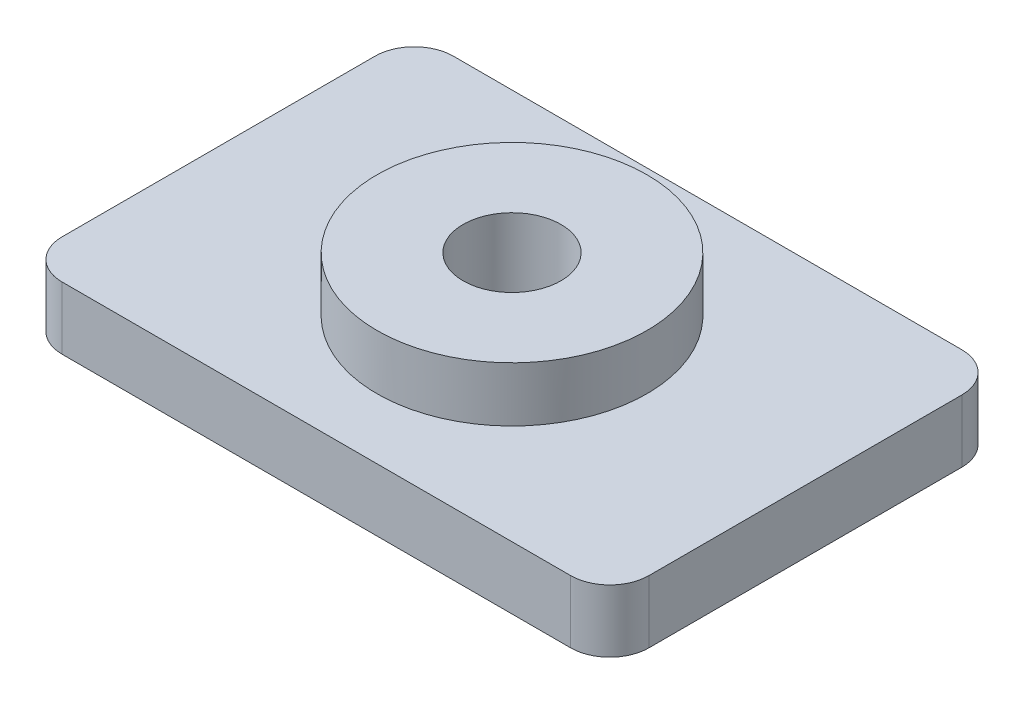
ISO-10303-21;
HEADER;
FILE_DESCRIPTION(('STEP AP214'),'2;1');
FILE_NAME('part.step','',(''),(''),'','','');
FILE_SCHEMA(('AUTOMOTIVE_DESIGN { 1 0 10303 214 1 1 1 1 }'));
ENDSEC;
DATA;
#1=APPLICATION_CONTEXT('core data for automotive mechanical design processes');
#2=APPLICATION_PROTOCOL_DEFINITION('international standard','automotive_design',2000,#1);
#3=PRODUCT_CONTEXT('',#1,'mechanical');
#4=PRODUCT('Part','Part','',(#3));
#5=PRODUCT_RELATED_PRODUCT_CATEGORY('part','',(#4));
#6=PRODUCT_DEFINITION_FORMATION('','',#4);
#7=PRODUCT_DEFINITION_CONTEXT('part definition',#1,'design');
#8=PRODUCT_DEFINITION('design','',#6,#7);
#9=PRODUCT_DEFINITION_SHAPE('','',#8);
#10=(LENGTH_UNIT() NAMED_UNIT(*) SI_UNIT(.MILLI.,.METRE.));
#11=(NAMED_UNIT(*) PLANE_ANGLE_UNIT() SI_UNIT($,.RADIAN.));
#12=(NAMED_UNIT(*) SI_UNIT($,.STERADIAN.) SOLID_ANGLE_UNIT());
#13=UNCERTAINTY_MEASURE_WITH_UNIT(LENGTH_MEASURE(1.E-05),#10,'distance_accuracy_value','');
#14=(GEOMETRIC_REPRESENTATION_CONTEXT(3) GLOBAL_UNCERTAINTY_ASSIGNED_CONTEXT((#13)) GLOBAL_UNIT_ASSIGNED_CONTEXT((#10,
#11,#12)) REPRESENTATION_CONTEXT('',''));
#15=CARTESIAN_POINT('',(0.,0.,0.));
#16=DIRECTION('',(0.,0.,1.));
#17=DIRECTION('',(1.,0.,0.));
#18=AXIS2_PLACEMENT_3D('',#15,#16,#17);
#19=CARTESIAN_POINT('',(14.,1.6,-9.));
#20=DIRECTION('',(0.,-1.,0.));
#21=DIRECTION('',(0.,0.,-1.));
#22=AXIS2_PLACEMENT_3D('',#19,#20,#21);
#23=PLANE('',#22);
#24=CARTESIAN_POINT('',(14.,1.6,-9.));
#25=DIRECTION('',(0.,1.,0.));
#26=DIRECTION('',(0.,0.,-1.));
#27=AXIS2_PLACEMENT_3D('',#24,#25,#26);
#28=CIRCLE('',#27,1.);
#29=CARTESIAN_POINT('',(15.,1.6,-8.99999999999999));
#30=VERTEX_POINT('',#29);
#31=CARTESIAN_POINT('',(14.,1.6,-10.));
#32=VERTEX_POINT('',#31);
#33=EDGE_CURVE('E145',#30,#32,#28,.T.);
#34=ORIENTED_EDGE('',*,*,#33,.T.);
#35=DIRECTION('',(-1.,0.,0.));
#36=VECTOR('',#35,1.);
#37=CARTESIAN_POINT('',(1.00000000000001,1.6,-10.));
#38=LINE('',#37,#36);
#39=CARTESIAN_POINT('',(1.00000000000001,1.6,-10.));
#40=VERTEX_POINT('',#39);
#41=EDGE_CURVE('E93',#32,#40,#38,.T.);
#42=ORIENTED_EDGE('',*,*,#41,.T.);
#43=CARTESIAN_POINT('',(1.,1.6,-9.));
#44=DIRECTION('',(0.,1.,0.));
#45=DIRECTION('',(0.,0.,-1.));
#46=AXIS2_PLACEMENT_3D('',#43,#44,#45);
#47=CIRCLE('',#46,1.);
#48=CARTESIAN_POINT('',(0.,1.6,-8.99999999999999));
#49=VERTEX_POINT('',#48);
#50=EDGE_CURVE('E176',#40,#49,#47,.T.);
#51=ORIENTED_EDGE('',*,*,#50,.T.);
#52=DIRECTION('',(0.,0.,1.));
#53=VECTOR('',#52,1.);
#54=CARTESIAN_POINT('',(0.,1.6,-1.00000000000001));
#55=LINE('',#54,#53);
#56=CARTESIAN_POINT('',(0.,1.6,-1.00000000000001));
#57=VERTEX_POINT('',#56);
#58=EDGE_CURVE('E175',#49,#57,#55,.T.);
#59=ORIENTED_EDGE('',*,*,#58,.T.);
#60=CARTESIAN_POINT('',(1.,1.6,-1.));
#61=DIRECTION('',(0.,1.,0.));
#62=DIRECTION('',(0.,0.,-1.));
#63=AXIS2_PLACEMENT_3D('',#60,#61,#62);
#64=CIRCLE('',#63,1.);
#65=CARTESIAN_POINT('',(1.00000000000001,1.6,0.));
#66=VERTEX_POINT('',#65);
#67=EDGE_CURVE('E112',#57,#66,#64,.T.);
#68=ORIENTED_EDGE('',*,*,#67,.T.);
#69=DIRECTION('',(1.,0.,0.));
#70=VECTOR('',#69,1.);
#71=CARTESIAN_POINT('',(1.00000000000001,1.6,0.));
#72=LINE('',#71,#70);
#73=CARTESIAN_POINT('',(14.,1.6,0.));
#74=VERTEX_POINT('',#73);
#75=EDGE_CURVE('E106',#66,#74,#72,.T.);
#76=ORIENTED_EDGE('',*,*,#75,.T.);
#77=CARTESIAN_POINT('',(14.,1.6,-1.));
#78=DIRECTION('',(0.,1.,0.));
#79=DIRECTION('',(0.,0.,1.));
#80=AXIS2_PLACEMENT_3D('',#77,#78,#79);
#81=CIRCLE('',#80,1.);
#82=CARTESIAN_POINT('',(15.,1.6,-1.00000000000001));
#83=VERTEX_POINT('',#82);
#84=EDGE_CURVE('E110',#74,#83,#81,.T.);
#85=ORIENTED_EDGE('',*,*,#84,.T.);
#86=DIRECTION('',(0.,0.,-1.));
#87=VECTOR('',#86,1.);
#88=CARTESIAN_POINT('',(15.,1.6,-1.00000000000001));
#89=LINE('',#88,#87);
#90=EDGE_CURVE('E49',#83,#30,#89,.T.);
#91=ORIENTED_EDGE('',*,*,#90,.T.);
#92=EDGE_LOOP('',(#34,#42,#51,#59,#68,#76,#85,#91));
#93=FACE_BOUND('',#92,.T.);
#94=CARTESIAN_POINT('',(7.5,1.6,-5.));
#95=DIRECTION('',(0.,-1.,0.));
#96=DIRECTION('',(0.,0.,-1.));
#97=AXIS2_PLACEMENT_3D('',#94,#95,#96);
#98=CIRCLE('',#97,3.45);
#99=CARTESIAN_POINT('',(7.5,1.6,-8.45));
#100=VERTEX_POINT('',#99);
#101=EDGE_CURVE('E11',#100,#100,#98,.F.);
#102=ORIENTED_EDGE('',*,*,#101,.F.);
#103=EDGE_LOOP('',(#102));
#104=FACE_BOUND('',#103,.T.);
#105=ADVANCED_FACE('F32',(#93,#104),#23,.F.);
#106=CARTESIAN_POINT('',(14.,1.6,-9.));
#107=DIRECTION('',(0.,-1.,0.));
#108=DIRECTION('',(0.,0.,-1.));
#109=AXIS2_PLACEMENT_3D('',#106,#107,#108);
#110=CYLINDRICAL_SURFACE('',#109,1.);
#111=CARTESIAN_POINT('',(14.,0.,-9.));
#112=DIRECTION('',(0.,1.,0.));
#113=DIRECTION('',(0.,0.,-1.));
#114=AXIS2_PLACEMENT_3D('',#111,#112,#113);
#115=CIRCLE('',#114,1.);
#116=CARTESIAN_POINT('',(15.,0.,-8.99999999999999));
#117=VERTEX_POINT('',#116);
#118=CARTESIAN_POINT('',(14.,0.,-10.));
#119=VERTEX_POINT('',#118);
#120=EDGE_CURVE('E130',#117,#119,#115,.T.);
#121=ORIENTED_EDGE('',*,*,#120,.T.);
#122=DIRECTION('',(0.,-1.,0.));
#123=VECTOR('',#122,1.);
#124=CARTESIAN_POINT('',(14.,1.6,-10.));
#125=LINE('',#124,#123);
#126=EDGE_CURVE('E41',#32,#119,#125,.T.);
#127=ORIENTED_EDGE('',*,*,#126,.F.);
#128=ORIENTED_EDGE('',*,*,#33,.F.);
#129=DIRECTION('',(0.,-1.,0.));
#130=VECTOR('',#129,1.);
#131=CARTESIAN_POINT('',(15.,1.6,-8.99999999999999));
#132=LINE('',#131,#130);
#133=EDGE_CURVE('E126',#30,#117,#132,.T.);
#134=ORIENTED_EDGE('',*,*,#133,.T.);
#135=EDGE_LOOP('',(#121,#127,#128,#134));
#136=FACE_BOUND('',#135,.T.);
#137=ADVANCED_FACE('F34',(#136),#110,.T.);
#138=CARTESIAN_POINT('',(1.00000000000001,1.6,-10.));
#139=DIRECTION('',(0.,0.,1.));
#140=DIRECTION('',(1.,0.,0.));
#141=AXIS2_PLACEMENT_3D('',#138,#139,#140);
#142=PLANE('',#141);
#143=DIRECTION('',(-1.,0.,0.));
#144=VECTOR('',#143,1.);
#145=CARTESIAN_POINT('',(1.00000000000001,0.,-10.));
#146=LINE('',#145,#144);
#147=CARTESIAN_POINT('',(1.00000000000001,0.,-10.));
#148=VERTEX_POINT('',#147);
#149=EDGE_CURVE('E133',#119,#148,#146,.T.);
#150=ORIENTED_EDGE('',*,*,#149,.T.);
#151=DIRECTION('',(0.,-1.,0.));
#152=VECTOR('',#151,1.);
#153=CARTESIAN_POINT('',(1.00000000000001,1.6,-10.));
#154=LINE('',#153,#152);
#155=EDGE_CURVE('E155',#40,#148,#154,.T.);
#156=ORIENTED_EDGE('',*,*,#155,.F.);
#157=ORIENTED_EDGE('',*,*,#41,.F.);
#158=ORIENTED_EDGE('',*,*,#126,.T.);
#159=EDGE_LOOP('',(#150,#156,#157,#158));
#160=FACE_BOUND('',#159,.T.);
#161=ADVANCED_FACE('F158',(#160),#142,.F.);
#162=CARTESIAN_POINT('',(1.,1.6,-9.));
#163=DIRECTION('',(0.,-1.,0.));
#164=DIRECTION('',(0.,0.,-1.));
#165=AXIS2_PLACEMENT_3D('',#162,#163,#164);
#166=CYLINDRICAL_SURFACE('',#165,1.);
#167=CARTESIAN_POINT('',(1.,0.,-9.));
#168=DIRECTION('',(0.,1.,0.));
#169=DIRECTION('',(0.,0.,-1.));
#170=AXIS2_PLACEMENT_3D('',#167,#168,#169);
#171=CIRCLE('',#170,1.);
#172=CARTESIAN_POINT('',(0.,0.,-8.99999999999999));
#173=VERTEX_POINT('',#172);
#174=EDGE_CURVE('E136',#148,#173,#171,.T.);
#175=ORIENTED_EDGE('',*,*,#174,.T.);
#176=DIRECTION('',(0.,-1.,0.));
#177=VECTOR('',#176,1.);
#178=CARTESIAN_POINT('',(0.,1.6,-8.99999999999999));
#179=LINE('',#178,#177);
#180=EDGE_CURVE('E152',#49,#173,#179,.T.);
#181=ORIENTED_EDGE('',*,*,#180,.F.);
#182=ORIENTED_EDGE('',*,*,#50,.F.);
#183=ORIENTED_EDGE('',*,*,#155,.T.);
#184=EDGE_LOOP('',(#175,#181,#182,#183));
#185=FACE_BOUND('',#184,.T.);
#186=ADVANCED_FACE('F169',(#185),#166,.T.);
#187=CARTESIAN_POINT('',(0.,1.6,-1.00000000000001));
#188=DIRECTION('',(1.,0.,0.));
#189=DIRECTION('',(0.,0.,-1.));
#190=AXIS2_PLACEMENT_3D('',#187,#188,#189);
#191=PLANE('',#190);
#192=DIRECTION('',(0.,0.,1.));
#193=VECTOR('',#192,1.);
#194=CARTESIAN_POINT('',(0.,0.,-1.00000000000001));
#195=LINE('',#194,#193);
#196=CARTESIAN_POINT('',(0.,0.,-1.00000000000001));
#197=VERTEX_POINT('',#196);
#198=EDGE_CURVE('E138',#173,#197,#195,.T.);
#199=ORIENTED_EDGE('',*,*,#198,.T.);
#200=DIRECTION('',(0.,-1.,0.));
#201=VECTOR('',#200,1.);
#202=CARTESIAN_POINT('',(0.,1.6,-1.00000000000001));
#203=LINE('',#202,#201);
#204=EDGE_CURVE('E149',#57,#197,#203,.T.);
#205=ORIENTED_EDGE('',*,*,#204,.F.);
#206=ORIENTED_EDGE('',*,*,#58,.F.);
#207=ORIENTED_EDGE('',*,*,#180,.T.);
#208=EDGE_LOOP('',(#199,#205,#206,#207));
#209=FACE_BOUND('',#208,.T.);
#210=ADVANCED_FACE('F173',(#209),#191,.F.);
#211=CARTESIAN_POINT('',(1.,1.6,-1.));
#212=DIRECTION('',(0.,-1.,0.));
#213=DIRECTION('',(0.,0.,-1.));
#214=AXIS2_PLACEMENT_3D('',#211,#212,#213);
#215=CYLINDRICAL_SURFACE('',#214,1.);
#216=CARTESIAN_POINT('',(1.,0.,-1.));
#217=DIRECTION('',(0.,1.,0.));
#218=DIRECTION('',(0.,0.,-1.));
#219=AXIS2_PLACEMENT_3D('',#216,#217,#218);
#220=CIRCLE('',#219,1.);
#221=CARTESIAN_POINT('',(1.00000000000001,0.,0.));
#222=VERTEX_POINT('',#221);
#223=EDGE_CURVE('E140',#197,#222,#220,.T.);
#224=ORIENTED_EDGE('',*,*,#223,.T.);
#225=DIRECTION('',(0.,-1.,0.));
#226=VECTOR('',#225,1.);
#227=CARTESIAN_POINT('',(1.00000000000001,1.6,0.));
#228=LINE('',#227,#226);
#229=EDGE_CURVE('E121',#66,#222,#228,.T.);
#230=ORIENTED_EDGE('',*,*,#229,.F.);
#231=ORIENTED_EDGE('',*,*,#67,.F.);
#232=ORIENTED_EDGE('',*,*,#204,.T.);
#233=EDGE_LOOP('',(#224,#230,#231,#232));
#234=FACE_BOUND('',#233,.T.);
#235=ADVANCED_FACE('F220',(#234),#215,.T.);
#236=CARTESIAN_POINT('',(1.00000000000001,1.6,0.));
#237=DIRECTION('',(0.,0.,-1.));
#238=DIRECTION('',(-1.,0.,0.));
#239=AXIS2_PLACEMENT_3D('',#236,#237,#238);
#240=PLANE('',#239);
#241=DIRECTION('',(1.,0.,0.));
#242=VECTOR('',#241,1.);
#243=CARTESIAN_POINT('',(1.00000000000001,0.,0.));
#244=LINE('',#243,#242);
#245=CARTESIAN_POINT('',(14.,0.,0.));
#246=VERTEX_POINT('',#245);
#247=EDGE_CURVE('E120',#222,#246,#244,.T.);
#248=ORIENTED_EDGE('',*,*,#247,.T.);
#249=DIRECTION('',(0.,-1.,0.));
#250=VECTOR('',#249,1.);
#251=CARTESIAN_POINT('',(14.,1.6,0.));
#252=LINE('',#251,#250);
#253=EDGE_CURVE('E117',#74,#246,#252,.T.);
#254=ORIENTED_EDGE('',*,*,#253,.F.);
#255=ORIENTED_EDGE('',*,*,#75,.F.);
#256=ORIENTED_EDGE('',*,*,#229,.T.);
#257=EDGE_LOOP('',(#248,#254,#255,#256));
#258=FACE_BOUND('',#257,.T.);
#259=ADVANCED_FACE('F118',(#258),#240,.F.);
#260=CARTESIAN_POINT('',(14.,1.6,-1.));
#261=DIRECTION('',(0.,-1.,0.));
#262=DIRECTION('',(0.,0.,-1.));
#263=AXIS2_PLACEMENT_3D('',#260,#261,#262);
#264=CYLINDRICAL_SURFACE('',#263,1.);
#265=CARTESIAN_POINT('',(14.,0.,-1.));
#266=DIRECTION('',(0.,1.,0.));
#267=DIRECTION('',(0.,0.,1.));
#268=AXIS2_PLACEMENT_3D('',#265,#266,#267);
#269=CIRCLE('',#268,1.);
#270=CARTESIAN_POINT('',(15.,0.,-1.00000000000001));
#271=VERTEX_POINT('',#270);
#272=EDGE_CURVE('E78',#246,#271,#269,.T.);
#273=ORIENTED_EDGE('',*,*,#272,.T.);
#274=DIRECTION('',(0.,-1.,0.));
#275=VECTOR('',#274,1.);
#276=CARTESIAN_POINT('',(15.,1.6,-1.00000000000001));
#277=LINE('',#276,#275);
#278=EDGE_CURVE('E122',#83,#271,#277,.T.);
#279=ORIENTED_EDGE('',*,*,#278,.F.);
#280=ORIENTED_EDGE('',*,*,#84,.F.);
#281=ORIENTED_EDGE('',*,*,#253,.T.);
#282=EDGE_LOOP('',(#273,#279,#280,#281));
#283=FACE_BOUND('',#282,.T.);
#284=ADVANCED_FACE('F124',(#283),#264,.T.);
#285=CARTESIAN_POINT('',(15.,1.6,-1.00000000000001));
#286=DIRECTION('',(-1.,0.,0.));
#287=DIRECTION('',(0.,0.,1.));
#288=AXIS2_PLACEMENT_3D('',#285,#286,#287);
#289=PLANE('',#288);
#290=DIRECTION('',(0.,0.,-1.));
#291=VECTOR('',#290,1.);
#292=CARTESIAN_POINT('',(15.,0.,-1.00000000000001));
#293=LINE('',#292,#291);
#294=EDGE_CURVE('E84',#271,#117,#293,.T.);
#295=ORIENTED_EDGE('',*,*,#294,.T.);
#296=ORIENTED_EDGE('',*,*,#133,.F.);
#297=ORIENTED_EDGE('',*,*,#90,.F.);
#298=ORIENTED_EDGE('',*,*,#278,.T.);
#299=EDGE_LOOP('',(#295,#296,#297,#298));
#300=FACE_BOUND('',#299,.T.);
#301=ADVANCED_FACE('F212',(#300),#289,.F.);
#302=CARTESIAN_POINT('',(14.,0.,-9.));
#303=DIRECTION('',(0.,-1.,0.));
#304=DIRECTION('',(0.,0.,-1.));
#305=AXIS2_PLACEMENT_3D('',#302,#303,#304);
#306=PLANE('',#305);
#307=CARTESIAN_POINT('',(7.5,0.,-5.));
#308=DIRECTION('',(0.,-1.,0.));
#309=DIRECTION('',(0.,0.,-1.));
#310=AXIS2_PLACEMENT_3D('',#307,#308,#309);
#311=CIRCLE('',#310,1.25);
#312=CARTESIAN_POINT('',(7.5,0.,-6.25));
#313=VERTEX_POINT('',#312);
#314=EDGE_CURVE('E185',#313,#313,#311,.F.);
#315=ORIENTED_EDGE('',*,*,#314,.T.);
#316=EDGE_LOOP('',(#315));
#317=FACE_BOUND('',#316,.T.);
#318=ORIENTED_EDGE('',*,*,#120,.F.);
#319=ORIENTED_EDGE('',*,*,#294,.F.);
#320=ORIENTED_EDGE('',*,*,#272,.F.);
#321=ORIENTED_EDGE('',*,*,#247,.F.);
#322=ORIENTED_EDGE('',*,*,#223,.F.);
#323=ORIENTED_EDGE('',*,*,#198,.F.);
#324=ORIENTED_EDGE('',*,*,#174,.F.);
#325=ORIENTED_EDGE('',*,*,#149,.F.);
#326=EDGE_LOOP('',(#318,#319,#320,#321,#322,#323,#324,#325));
#327=FACE_BOUND('',#326,.T.);
#328=ADVANCED_FACE('F163',(#317,#327),#306,.T.);
#329=CARTESIAN_POINT('',(7.5,3.,-5.));
#330=DIRECTION('',(0.,-1.,0.));
#331=DIRECTION('',(0.,0.,-1.));
#332=AXIS2_PLACEMENT_3D('',#329,#330,#331);
#333=CYLINDRICAL_SURFACE('',#332,3.45);
#334=CARTESIAN_POINT('',(7.5,3.,-5.));
#335=DIRECTION('',(0.,1.,0.));
#336=DIRECTION('',(0.,0.,1.));
#337=AXIS2_PLACEMENT_3D('',#334,#335,#336);
#338=CIRCLE('',#337,3.45);
#339=CARTESIAN_POINT('',(7.5,3.,-1.55));
#340=VERTEX_POINT('',#339);
#341=EDGE_CURVE('E134',#340,#340,#338,.T.);
#342=ORIENTED_EDGE('',*,*,#341,.F.);
#343=EDGE_LOOP('',(#342));
#344=FACE_BOUND('',#343,.T.);
#345=ORIENTED_EDGE('',*,*,#101,.T.);
#346=EDGE_LOOP('',(#345));
#347=FACE_BOUND('',#346,.T.);
#348=ADVANCED_FACE('F196',(#344,#347),#333,.T.);
#349=CARTESIAN_POINT('',(7.5,3.,-5.));
#350=DIRECTION('',(0.,1.,0.));
#351=DIRECTION('',(0.,0.,1.));
#352=AXIS2_PLACEMENT_3D('',#349,#350,#351);
#353=PLANE('',#352);
#354=CARTESIAN_POINT('',(7.5,3.,-5.));
#355=DIRECTION('',(0.,1.,0.));
#356=DIRECTION('',(0.,0.,1.));
#357=AXIS2_PLACEMENT_3D('',#354,#355,#356);
#358=CIRCLE('',#357,1.25);
#359=CARTESIAN_POINT('',(7.5,3.,-3.75));
#360=VERTEX_POINT('',#359);
#361=EDGE_CURVE('E184',#360,#360,#358,.T.);
#362=ORIENTED_EDGE('',*,*,#361,.F.);
#363=EDGE_LOOP('',(#362));
#364=FACE_BOUND('',#363,.T.);
#365=ORIENTED_EDGE('',*,*,#341,.T.);
#366=EDGE_LOOP('',(#365));
#367=FACE_BOUND('',#366,.T.);
#368=ADVANCED_FACE('F193',(#364,#367),#353,.T.);
#369=CARTESIAN_POINT('',(7.5,-0.00100000000000013,-5.));
#370=DIRECTION('',(0.,1.,0.));
#371=DIRECTION('',(0.,0.,1.));
#372=AXIS2_PLACEMENT_3D('',#369,#370,#371);
#373=CYLINDRICAL_SURFACE('',#372,1.25);
#374=ORIENTED_EDGE('',*,*,#314,.F.);
#375=EDGE_LOOP('',(#374));
#376=FACE_BOUND('',#375,.T.);
#377=ORIENTED_EDGE('',*,*,#361,.T.);
#378=EDGE_LOOP('',(#377));
#379=FACE_BOUND('',#378,.T.);
#380=ADVANCED_FACE('F191',(#376,#379),#373,.F.);
#381=CLOSED_SHELL('',(#105,#137,#161,#186,#210,#235,#259,#284,#301,#328,#348,#368,#380));
#382=MANIFOLD_SOLID_BREP('B2',#381);
#383=ADVANCED_BREP_SHAPE_REPRESENTATION('',(#18,#382),#14);
#384=SHAPE_DEFINITION_REPRESENTATION(#9,#383);
ENDSEC;
END-ISO-10303-21;
